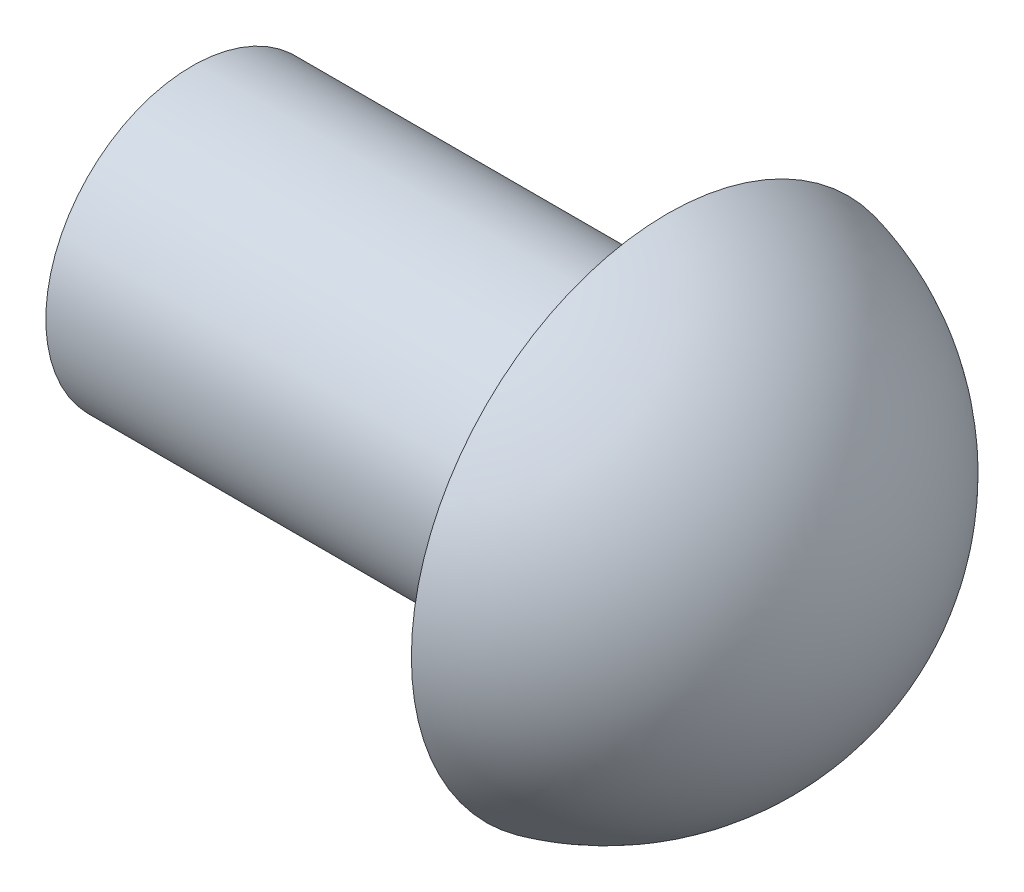
ISO-10303-21;
HEADER;
FILE_DESCRIPTION(('STEP AP214'),'2;1');
FILE_NAME('part.step','',(''),(''),'','','');
FILE_SCHEMA(('AUTOMOTIVE_DESIGN { 1 0 10303 214 1 1 1 1 }'));
ENDSEC;
DATA;
#1=APPLICATION_CONTEXT('core data for automotive mechanical design processes');
#2=APPLICATION_PROTOCOL_DEFINITION('international standard','automotive_design',2000,#1);
#3=PRODUCT_CONTEXT('',#1,'mechanical');
#4=PRODUCT('Part','Part','',(#3));
#5=PRODUCT_RELATED_PRODUCT_CATEGORY('part','',(#4));
#6=PRODUCT_DEFINITION_FORMATION('','',#4);
#7=PRODUCT_DEFINITION_CONTEXT('part definition',#1,'design');
#8=PRODUCT_DEFINITION('design','',#6,#7);
#9=PRODUCT_DEFINITION_SHAPE('','',#8);
#10=(LENGTH_UNIT() NAMED_UNIT(*) SI_UNIT(.MILLI.,.METRE.));
#11=(NAMED_UNIT(*) PLANE_ANGLE_UNIT() SI_UNIT($,.RADIAN.));
#12=(NAMED_UNIT(*) SI_UNIT($,.STERADIAN.) SOLID_ANGLE_UNIT());
#13=UNCERTAINTY_MEASURE_WITH_UNIT(LENGTH_MEASURE(1.E-05),#10,'distance_accuracy_value','');
#14=(GEOMETRIC_REPRESENTATION_CONTEXT(3) GLOBAL_UNCERTAINTY_ASSIGNED_CONTEXT((#13)) GLOBAL_UNIT_ASSIGNED_CONTEXT((#10,
#11,#12)) REPRESENTATION_CONTEXT('',''));
#15=CARTESIAN_POINT('',(0.,0.,0.));
#16=DIRECTION('',(0.,0.,1.));
#17=DIRECTION('',(1.,0.,0.));
#18=AXIS2_PLACEMENT_3D('',#15,#16,#17);
#19=CARTESIAN_POINT('',(6.5,0.,0.));
#20=DIRECTION('',(-1.,0.,0.));
#21=DIRECTION('',(0.,0.,1.));
#22=AXIS2_PLACEMENT_3D('',#19,#20,#21);
#23=CYLINDRICAL_SURFACE('',#22,2.);
#24=CARTESIAN_POINT('',(6.5,0.,0.));
#25=DIRECTION('',(1.,0.,0.));
#26=DIRECTION('',(0.,0.,-1.));
#27=AXIS2_PLACEMENT_3D('',#24,#25,#26);
#28=CIRCLE('',#27,2.);
#29=CARTESIAN_POINT('',(6.5,0.,-2.));
#30=VERTEX_POINT('',#29);
#31=EDGE_CURVE('E11',#30,#30,#28,.T.);
#32=ORIENTED_EDGE('',*,*,#31,.F.);
#33=EDGE_LOOP('',(#32));
#34=FACE_BOUND('',#33,.T.);
#35=CARTESIAN_POINT('',(0.,0.,0.));
#36=DIRECTION('',(1.,0.,0.));
#37=DIRECTION('',(0.,0.,-1.));
#38=AXIS2_PLACEMENT_3D('',#35,#36,#37);
#39=CIRCLE('',#38,2.);
#40=CARTESIAN_POINT('',(0.,0.,-2.));
#41=VERTEX_POINT('',#40);
#42=EDGE_CURVE('E46',#41,#41,#39,.T.);
#43=ORIENTED_EDGE('',*,*,#42,.T.);
#44=EDGE_LOOP('',(#43));
#45=FACE_BOUND('',#44,.T.);
#46=ADVANCED_FACE('F43',(#34,#45),#23,.T.);
#47=CARTESIAN_POINT('',(0.,0.,0.));
#48=DIRECTION('',(1.,0.,0.));
#49=DIRECTION('',(0.,0.,-1.));
#50=AXIS2_PLACEMENT_3D('',#47,#48,#49);
#51=PLANE('',#50);
#52=ORIENTED_EDGE('',*,*,#42,.F.);
#53=EDGE_LOOP('',(#52));
#54=FACE_BOUND('',#53,.T.);
#55=ADVANCED_FACE('F56',(#54),#51,.F.);
#56=CARTESIAN_POINT('',(5.66009299292302,0.,-0.000650827983704213));
#57=DIRECTION('',(0.,-1.,0.));
#58=DIRECTION('',(0.,0.,1.));
#59=AXIS2_PLACEMENT_3D('',#56,#57,#58);
#60=CIRCLE('',#59,3.6);
#61=TRIMMED_CURVE('',#60,(PARAMETER_VALUE(-1.57061554124288)),
(PARAMETER_VALUE(1.57061554124288)),.T.,.PARAMETER.);
#62=CARTESIAN_POINT('',(5.66009299292302,0.,0.));
#63=DIRECTION('',(-1.,0.,0.));
#64=AXIS1_PLACEMENT('',#62,#63);
#65=SURFACE_OF_REVOLUTION('',#61,#64);
#66=CARTESIAN_POINT('',(6.5,0.,0.));
#67=DIRECTION('',(-1.,0.,0.));
#68=DIRECTION('',(0.,0.,1.));
#69=AXIS2_PLACEMENT_3D('',#66,#67,#68);
#70=CIRCLE('',#69,3.5);
#71=CARTESIAN_POINT('',(6.5,0.,3.5));
#72=VERTEX_POINT('',#71);
#73=EDGE_CURVE('E76',#72,#72,#70,.T.);
#74=ORIENTED_EDGE('',*,*,#73,.F.);
#75=EDGE_LOOP('',(#74));
#76=FACE_BOUND('',#75,.T.);
#77=CARTESIAN_POINT('',(9.26009293409288,0.,0.));
#78=VERTEX_POINT('',#77);
#79=VERTEX_LOOP('',#78);
#80=FACE_BOUND('',#79,.T.);
#81=ADVANCED_FACE('F53',(#76,#80),#65,.T.);
#82=CARTESIAN_POINT('',(6.5,0.,0.));
#83=DIRECTION('',(1.,0.,0.));
#84=DIRECTION('',(0.,0.,-1.));
#85=AXIS2_PLACEMENT_3D('',#82,#83,#84);
#86=PLANE('',#85);
#87=ORIENTED_EDGE('',*,*,#31,.T.);
#88=EDGE_LOOP('',(#87));
#89=FACE_BOUND('',#88,.T.);
#90=ORIENTED_EDGE('',*,*,#73,.T.);
#91=EDGE_LOOP('',(#90));
#92=FACE_BOUND('',#91,.T.);
#93=ADVANCED_FACE('F55',(#89,#92),#86,.F.);
#94=CLOSED_SHELL('',(#46,#55,#81,#93));
#95=MANIFOLD_SOLID_BREP('B2',#94);
#96=ADVANCED_BREP_SHAPE_REPRESENTATION('',(#18,#95),#14);
#97=SHAPE_DEFINITION_REPRESENTATION(#9,#96);
ENDSEC;
END-ISO-10303-21;
